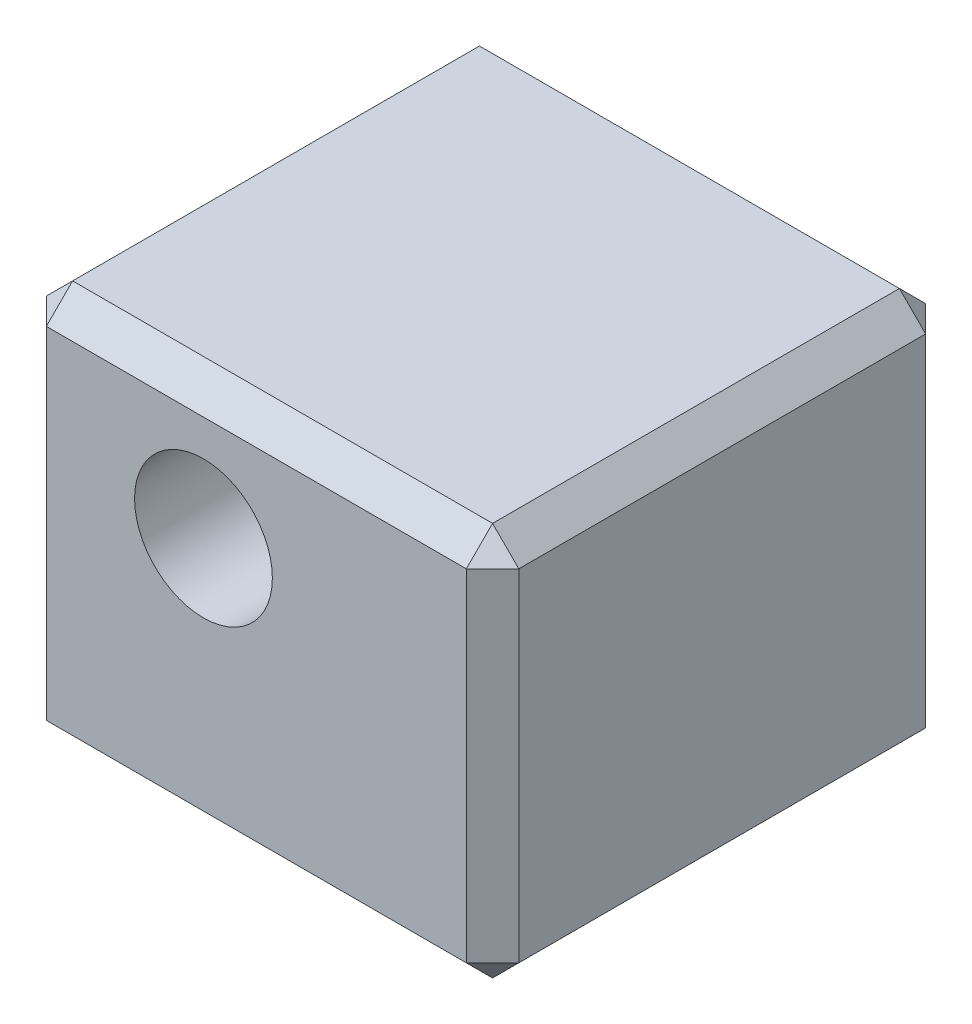
ISO-10303-21;
HEADER;
FILE_DESCRIPTION(('STEP AP214'),'2;1');
FILE_NAME('part.step','',(''),(''),'','','');
FILE_SCHEMA(('AUTOMOTIVE_DESIGN { 1 0 10303 214 1 1 1 1 }'));
ENDSEC;
DATA;
#1=APPLICATION_CONTEXT('core data for automotive mechanical design processes');
#2=APPLICATION_PROTOCOL_DEFINITION('international standard','automotive_design',2000,#1);
#3=PRODUCT_CONTEXT('',#1,'mechanical');
#4=PRODUCT('Part','Part','',(#3));
#5=PRODUCT_RELATED_PRODUCT_CATEGORY('part','',(#4));
#6=PRODUCT_DEFINITION_FORMATION('','',#4);
#7=PRODUCT_DEFINITION_CONTEXT('part definition',#1,'design');
#8=PRODUCT_DEFINITION('design','',#6,#7);
#9=PRODUCT_DEFINITION_SHAPE('','',#8);
#10=(LENGTH_UNIT() NAMED_UNIT(*) SI_UNIT(.MILLI.,.METRE.));
#11=(NAMED_UNIT(*) PLANE_ANGLE_UNIT() SI_UNIT($,.RADIAN.));
#12=(NAMED_UNIT(*) SI_UNIT($,.STERADIAN.) SOLID_ANGLE_UNIT());
#13=UNCERTAINTY_MEASURE_WITH_UNIT(LENGTH_MEASURE(1.E-05),#10,'distance_accuracy_value','');
#14=(GEOMETRIC_REPRESENTATION_CONTEXT(3) GLOBAL_UNCERTAINTY_ASSIGNED_CONTEXT((#13)) GLOBAL_UNIT_ASSIGNED_CONTEXT((#10,
#11,#12)) REPRESENTATION_CONTEXT('',''));
#15=CARTESIAN_POINT('',(0.,0.,0.));
#16=DIRECTION('',(0.,0.,1.));
#17=DIRECTION('',(1.,0.,0.));
#18=AXIS2_PLACEMENT_3D('',#15,#16,#17);
#19=CARTESIAN_POINT('',(-13.2722966665142,15.,-20.6283369875564));
#20=DIRECTION('',(1.,0.,0.));
#21=DIRECTION('',(0.,0.,-1.));
#22=AXIS2_PLACEMENT_3D('',#19,#20,#21);
#23=PLANE('',#22);
#24=DIRECTION('',(0.,0.,-1.));
#25=VECTOR('',#24,1.);
#26=CARTESIAN_POINT('',(-13.2722966665142,14.,-20.6283369875564));
#27=LINE('',#26,#25);
#28=CARTESIAN_POINT('',(-13.2722966665142,14.,-4.1283369875564));
#29=VERTEX_POINT('',#28);
#30=CARTESIAN_POINT('',(-13.2722966665142,14.,-19.6283369875564));
#31=VERTEX_POINT('',#30);
#32=EDGE_CURVE('E184',#29,#31,#27,.T.);
#33=ORIENTED_EDGE('',*,*,#32,.T.);
#34=DIRECTION('',(0.,-1.,0.));
#35=VECTOR('',#34,1.);
#36=CARTESIAN_POINT('',(-13.2722966665142,15.,-19.6283369875564));
#37=LINE('',#36,#35);
#38=CARTESIAN_POINT('',(-13.2722966665142,1.,-19.6283369875564));
#39=VERTEX_POINT('',#38);
#40=EDGE_CURVE('E186',#31,#39,#37,.T.);
#41=ORIENTED_EDGE('',*,*,#40,.T.);
#42=DIRECTION('',(0.,0.,1.));
#43=VECTOR('',#42,1.);
#44=CARTESIAN_POINT('',(-13.2722966665142,1.,-20.6283369875564));
#45=LINE('',#44,#43);
#46=CARTESIAN_POINT('',(-13.2722966665142,1.,-4.1283369875564));
#47=VERTEX_POINT('',#46);
#48=EDGE_CURVE('E180',#39,#47,#45,.T.);
#49=ORIENTED_EDGE('',*,*,#48,.T.);
#50=DIRECTION('',(0.,1.,0.));
#51=VECTOR('',#50,1.);
#52=CARTESIAN_POINT('',(-13.2722966665142,15.,-4.1283369875564));
#53=LINE('',#52,#51);
#54=EDGE_CURVE('E182',#47,#29,#53,.T.);
#55=ORIENTED_EDGE('',*,*,#54,.T.);
#56=EDGE_LOOP('',(#33,#41,#49,#55));
#57=FACE_BOUND('',#56,.T.);
#58=ADVANCED_FACE('F31',(#57),#23,.F.);
#59=CARTESIAN_POINT('',(4.7277033334858,15.,-2.6283369875564));
#60=DIRECTION('',(-1.,0.,0.));
#61=DIRECTION('',(0.,0.,1.));
#62=AXIS2_PLACEMENT_3D('',#59,#60,#61);
#63=PLANE('',#62);
#64=DIRECTION('',(0.,0.,-1.));
#65=VECTOR('',#64,1.);
#66=CARTESIAN_POINT('',(4.7277033334858,1.,-2.6283369875564));
#67=LINE('',#66,#65);
#68=CARTESIAN_POINT('',(4.7277033334858,1.,-4.1283369875564));
#69=VERTEX_POINT('',#68);
#70=CARTESIAN_POINT('',(4.7277033334858,1.,-19.6283369875564));
#71=VERTEX_POINT('',#70);
#72=EDGE_CURVE('E160',#69,#71,#67,.T.);
#73=ORIENTED_EDGE('',*,*,#72,.T.);
#74=DIRECTION('',(0.,1.,0.));
#75=VECTOR('',#74,1.);
#76=CARTESIAN_POINT('',(4.7277033334858,15.,-19.6283369875564));
#77=LINE('',#76,#75);
#78=CARTESIAN_POINT('',(4.7277033334858,14.,-19.6283369875564));
#79=VERTEX_POINT('',#78);
#80=EDGE_CURVE('E130',#71,#79,#77,.T.);
#81=ORIENTED_EDGE('',*,*,#80,.T.);
#82=DIRECTION('',(0.,0.,1.));
#83=VECTOR('',#82,1.);
#84=CARTESIAN_POINT('',(4.7277033334858,14.,-3.1283369875564));
#85=LINE('',#84,#83);
#86=CARTESIAN_POINT('',(4.7277033334858,14.,-4.1283369875564));
#87=VERTEX_POINT('',#86);
#88=EDGE_CURVE('E168',#79,#87,#85,.T.);
#89=ORIENTED_EDGE('',*,*,#88,.T.);
#90=DIRECTION('',(0.,-1.,0.));
#91=VECTOR('',#90,1.);
#92=CARTESIAN_POINT('',(4.7277033334858,15.,-4.1283369875564));
#93=LINE('',#92,#91);
#94=EDGE_CURVE('E162',#87,#69,#93,.T.);
#95=ORIENTED_EDGE('',*,*,#94,.T.);
#96=EDGE_LOOP('',(#73,#81,#89,#95));
#97=FACE_BOUND('',#96,.T.);
#98=ADVANCED_FACE('F293',(#97),#63,.F.);
#99=CARTESIAN_POINT('',(4.7277033334858,15.,-20.6283369875564));
#100=DIRECTION('',(0.,0.,1.));
#101=DIRECTION('',(1.,0.,0.));
#102=AXIS2_PLACEMENT_3D('',#99,#100,#101);
#103=PLANE('',#102);
#104=DIRECTION('',(1.,0.,0.));
#105=VECTOR('',#104,1.);
#106=CARTESIAN_POINT('',(4.7277033334858,14.,-20.6283369875564));
#107=LINE('',#106,#105);
#108=CARTESIAN_POINT('',(-12.2722966665142,14.,-20.6283369875564));
#109=VERTEX_POINT('',#108);
#110=CARTESIAN_POINT('',(3.7277033334858,14.,-20.6283369875564));
#111=VERTEX_POINT('',#110);
#112=EDGE_CURVE('E158',#109,#111,#107,.T.);
#113=ORIENTED_EDGE('',*,*,#112,.T.);
#114=DIRECTION('',(0.,-1.,0.));
#115=VECTOR('',#114,1.);
#116=CARTESIAN_POINT('',(3.7277033334858,15.,-20.6283369875564));
#117=LINE('',#116,#115);
#118=CARTESIAN_POINT('',(3.7277033334858,1.,-20.6283369875564));
#119=VERTEX_POINT('',#118);
#120=EDGE_CURVE('E128',#111,#119,#117,.T.);
#121=ORIENTED_EDGE('',*,*,#120,.T.);
#122=DIRECTION('',(-1.,0.,0.));
#123=VECTOR('',#122,1.);
#124=CARTESIAN_POINT('',(4.7277033334858,1.,-20.6283369875564));
#125=LINE('',#124,#123);
#126=CARTESIAN_POINT('',(-12.2722966665142,1.,-20.6283369875564));
#127=VERTEX_POINT('',#126);
#128=EDGE_CURVE('E146',#119,#127,#125,.T.);
#129=ORIENTED_EDGE('',*,*,#128,.T.);
#130=DIRECTION('',(0.,1.,0.));
#131=VECTOR('',#130,1.);
#132=CARTESIAN_POINT('',(-12.2722966665142,15.,-20.6283369875564));
#133=LINE('',#132,#131);
#134=EDGE_CURVE('E152',#127,#109,#133,.T.);
#135=ORIENTED_EDGE('',*,*,#134,.T.);
#136=EDGE_LOOP('',(#113,#121,#129,#135));
#137=FACE_BOUND('',#136,.T.);
#138=CARTESIAN_POINT('',(-6.2867966665142,10.,-20.6283369875564));
#139=DIRECTION('',(0.,0.,1.));
#140=DIRECTION('',(1.,0.,0.));
#141=AXIS2_PLACEMENT_3D('',#138,#139,#140);
#142=CIRCLE('',#141,2.625);
#143=CARTESIAN_POINT('',(-3.6617966665142,10.,-20.6283369875564));
#144=VERTEX_POINT('',#143);
#145=EDGE_CURVE('E153',#144,#144,#142,.T.);
#146=ORIENTED_EDGE('',*,*,#145,.T.);
#147=EDGE_LOOP('',(#146));
#148=FACE_BOUND('',#147,.T.);
#149=ADVANCED_FACE('F155',(#137,#148),#103,.F.);
#150=CARTESIAN_POINT('',(-13.2722966665142,15.,-2.6283369875564));
#151=DIRECTION('',(0.,1.,0.));
#152=DIRECTION('',(0.,0.,1.));
#153=AXIS2_PLACEMENT_3D('',#150,#151,#152);
#154=PLANE('',#153);
#155=DIRECTION('',(1.,0.,0.));
#156=VECTOR('',#155,1.);
#157=CARTESIAN_POINT('',(4.7277033334858,15.,-4.1283369875564));
#158=LINE('',#157,#156);
#159=CARTESIAN_POINT('',(-12.2722966665142,15.,-4.1283369875564));
#160=VERTEX_POINT('',#159);
#161=CARTESIAN_POINT('',(3.7277033334858,15.,-4.1283369875564));
#162=VERTEX_POINT('',#161);
#163=EDGE_CURVE('E171',#160,#162,#158,.T.);
#164=ORIENTED_EDGE('',*,*,#163,.T.);
#165=DIRECTION('',(0.,0.,-1.));
#166=VECTOR('',#165,1.);
#167=CARTESIAN_POINT('',(3.7277033334858,15.,-20.6283369875564));
#168=LINE('',#167,#166);
#169=CARTESIAN_POINT('',(3.7277033334858,15.,-19.6283369875564));
#170=VERTEX_POINT('',#169);
#171=EDGE_CURVE('E177',#162,#170,#168,.T.);
#172=ORIENTED_EDGE('',*,*,#171,.T.);
#173=DIRECTION('',(-1.,0.,0.));
#174=VECTOR('',#173,1.);
#175=CARTESIAN_POINT('',(-13.2722966665142,15.,-19.6283369875564));
#176=LINE('',#175,#174);
#177=CARTESIAN_POINT('',(-12.2722966665142,15.,-19.6283369875564));
#178=VERTEX_POINT('',#177);
#179=EDGE_CURVE('E175',#170,#178,#176,.T.);
#180=ORIENTED_EDGE('',*,*,#179,.T.);
#181=DIRECTION('',(0.,0.,1.));
#182=VECTOR('',#181,1.);
#183=CARTESIAN_POINT('',(-12.2722966665142,15.,-3.1283369875564));
#184=LINE('',#183,#182);
#185=EDGE_CURVE('E173',#178,#160,#184,.T.);
#186=ORIENTED_EDGE('',*,*,#185,.T.);
#187=EDGE_LOOP('',(#164,#172,#180,#186));
#188=FACE_BOUND('',#187,.T.);
#189=ADVANCED_FACE('F516',(#188),#154,.T.);
#190=CARTESIAN_POINT('',(-13.2722966665142,0.,-2.6283369875564));
#191=DIRECTION('',(0.,1.,0.));
#192=DIRECTION('',(0.,0.,1.));
#193=AXIS2_PLACEMENT_3D('',#190,#191,#192);
#194=PLANE('',#193);
#195=DIRECTION('',(1.,0.,0.));
#196=VECTOR('',#195,1.);
#197=CARTESIAN_POINT('',(-13.2722966665142,0.,-19.6283369875564));
#198=LINE('',#197,#196);
#199=CARTESIAN_POINT('',(-12.2722966665142,0.,-19.6283369875564));
#200=VERTEX_POINT('',#199);
#201=CARTESIAN_POINT('',(3.7277033334858,0.,-19.6283369875564));
#202=VERTEX_POINT('',#201);
#203=EDGE_CURVE('E198',#200,#202,#198,.T.);
#204=ORIENTED_EDGE('',*,*,#203,.T.);
#205=DIRECTION('',(0.,0.,1.));
#206=VECTOR('',#205,1.);
#207=CARTESIAN_POINT('',(3.7277033334858,0.,-2.6283369875564));
#208=LINE('',#207,#206);
#209=CARTESIAN_POINT('',(3.7277033334858,0.,-4.1283369875564));
#210=VERTEX_POINT('',#209);
#211=EDGE_CURVE('E11',#202,#210,#208,.T.);
#212=ORIENTED_EDGE('',*,*,#211,.T.);
#213=DIRECTION('',(-1.,0.,0.));
#214=VECTOR('',#213,1.);
#215=CARTESIAN_POINT('',(-13.2722966665142,0.,-4.1283369875564));
#216=LINE('',#215,#214);
#217=CARTESIAN_POINT('',(-12.2722966665142,0.,-4.1283369875564));
#218=VERTEX_POINT('',#217);
#219=EDGE_CURVE('E40',#210,#218,#216,.T.);
#220=ORIENTED_EDGE('',*,*,#219,.T.);
#221=DIRECTION('',(0.,0.,-1.));
#222=VECTOR('',#221,1.);
#223=CARTESIAN_POINT('',(-12.2722966665142,0.,-2.6283369875564));
#224=LINE('',#223,#222);
#225=EDGE_CURVE('E200',#218,#200,#224,.T.);
#226=ORIENTED_EDGE('',*,*,#225,.T.);
#227=EDGE_LOOP('',(#204,#212,#220,#226));
#228=FACE_BOUND('',#227,.T.);
#229=CARTESIAN_POINT('',(-4.27229666651419,0.,-11.6283369875564));
#230=DIRECTION('',(0.,-1.,0.));
#231=DIRECTION('',(0.,0.,-1.));
#232=AXIS2_PLACEMENT_3D('',#229,#230,#231);
#233=CIRCLE('',#232,5.75);
#234=CARTESIAN_POINT('',(-4.27229666651419,0.,-17.3783369875564));
#235=VERTEX_POINT('',#234);
#236=EDGE_CURVE('E262',#235,#235,#233,.T.);
#237=ORIENTED_EDGE('',*,*,#236,.F.);
#238=EDGE_LOOP('',(#237));
#239=FACE_BOUND('',#238,.T.);
#240=ADVANCED_FACE('F296',(#228,#239),#194,.F.);
#241=CARTESIAN_POINT('',(-6.2867966665142,10.,-20.6283369875564));
#242=DIRECTION('',(0.,0.,1.));
#243=DIRECTION('',(1.,0.,0.));
#244=AXIS2_PLACEMENT_3D('',#241,#242,#243);
#245=CYLINDRICAL_SURFACE('',#244,2.625);
#246=CARTESIAN_POINT('',(-6.2867966665142,10.,-3.1283369875564));
#247=DIRECTION('',(0.,0.,-1.));
#248=DIRECTION('',(-1.,0.,0.));
#249=AXIS2_PLACEMENT_3D('',#246,#247,#248);
#250=CIRCLE('',#249,2.625);
#251=CARTESIAN_POINT('',(-8.9117966665142,10.,-3.1283369875564));
#252=VERTEX_POINT('',#251);
#253=EDGE_CURVE('E256',#252,#252,#250,.F.);
#254=ORIENTED_EDGE('',*,*,#253,.T.);
#255=EDGE_LOOP('',(#254));
#256=FACE_BOUND('',#255,.T.);
#257=ORIENTED_EDGE('',*,*,#145,.F.);
#258=EDGE_LOOP('',(#257));
#259=FACE_BOUND('',#258,.T.);
#260=ADVANCED_FACE('F502',(#256,#259),#245,.F.);
#261=CARTESIAN_POINT('',(-4.27229666651419,7.,-11.6283369875564));
#262=DIRECTION('',(0.,-1.,0.));
#263=DIRECTION('',(0.,0.,-1.));
#264=AXIS2_PLACEMENT_3D('',#261,#262,#263);
#265=CYLINDRICAL_SURFACE('',#264,5.75);
#266=CARTESIAN_POINT('',(-4.27229666651419,7.,-11.6283369875564));
#267=DIRECTION('',(0.,-1.,0.));
#268=DIRECTION('',(0.,0.,-1.));
#269=AXIS2_PLACEMENT_3D('',#266,#267,#268);
#270=CIRCLE('',#269,5.75);
#271=CARTESIAN_POINT('',(-4.27229666651419,7.,-17.3783369875564));
#272=VERTEX_POINT('',#271);
#273=EDGE_CURVE('E267',#272,#272,#270,.T.);
#274=ORIENTED_EDGE('',*,*,#273,.F.);
#275=EDGE_LOOP('',(#274));
#276=FACE_BOUND('',#275,.T.);
#277=ORIENTED_EDGE('',*,*,#236,.T.);
#278=EDGE_LOOP('',(#277));
#279=FACE_BOUND('',#278,.T.);
#280=ADVANCED_FACE('F492',(#276,#279),#265,.F.);
#281=CARTESIAN_POINT('',(-4.27229666651419,7.,-11.6283369875564));
#282=DIRECTION('',(0.,-1.,0.));
#283=DIRECTION('',(0.,0.,-1.));
#284=AXIS2_PLACEMENT_3D('',#281,#282,#283);
#285=PLANE('',#284);
#286=ORIENTED_EDGE('',*,*,#273,.T.);
#287=EDGE_LOOP('',(#286));
#288=FACE_BOUND('',#287,.T.);
#289=ADVANCED_FACE('F482',(#288),#285,.T.);
#290=CARTESIAN_POINT('',(4.7277033334858,15.,-3.1283369875564));
#291=DIRECTION('',(0.,0.,-1.));
#292=DIRECTION('',(-1.,0.,0.));
#293=AXIS2_PLACEMENT_3D('',#290,#291,#292);
#294=PLANE('',#293);
#295=DIRECTION('',(-1.,0.,0.));
#296=VECTOR('',#295,1.);
#297=CARTESIAN_POINT('',(-13.2722966665142,14.,-3.1283369875564));
#298=LINE('',#297,#296);
#299=CARTESIAN_POINT('',(3.7277033334858,14.,-3.1283369875564));
#300=VERTEX_POINT('',#299);
#301=CARTESIAN_POINT('',(-12.2722966665142,14.,-3.1283369875564));
#302=VERTEX_POINT('',#301);
#303=EDGE_CURVE('E193',#300,#302,#298,.T.);
#304=ORIENTED_EDGE('',*,*,#303,.T.);
#305=DIRECTION('',(0.,-1.,0.));
#306=VECTOR('',#305,1.);
#307=CARTESIAN_POINT('',(-12.2722966665142,15.,-3.1283369875564));
#308=LINE('',#307,#306);
#309=CARTESIAN_POINT('',(-12.2722966665142,1.,-3.1283369875564));
#310=VERTEX_POINT('',#309);
#311=EDGE_CURVE('E195',#302,#310,#308,.T.);
#312=ORIENTED_EDGE('',*,*,#311,.T.);
#313=DIRECTION('',(1.,0.,0.));
#314=VECTOR('',#313,1.);
#315=CARTESIAN_POINT('',(4.7277033334858,1.,-3.1283369875564));
#316=LINE('',#315,#314);
#317=CARTESIAN_POINT('',(3.7277033334858,1.,-3.1283369875564));
#318=VERTEX_POINT('',#317);
#319=EDGE_CURVE('E189',#310,#318,#316,.T.);
#320=ORIENTED_EDGE('',*,*,#319,.T.);
#321=DIRECTION('',(0.,1.,0.));
#322=VECTOR('',#321,1.);
#323=CARTESIAN_POINT('',(3.7277033334858,15.,-3.1283369875564));
#324=LINE('',#323,#322);
#325=EDGE_CURVE('E191',#318,#300,#324,.T.);
#326=ORIENTED_EDGE('',*,*,#325,.T.);
#327=EDGE_LOOP('',(#304,#312,#320,#326));
#328=FACE_BOUND('',#327,.T.);
#329=ORIENTED_EDGE('',*,*,#253,.F.);
#330=EDGE_LOOP('',(#329));
#331=FACE_BOUND('',#330,.T.);
#332=ADVANCED_FACE('F474',(#328,#331),#294,.F.);
#333=CARTESIAN_POINT('',(-12.2722966665142,15.,-3.1283369875564));
#334=DIRECTION('',(0.707106781186548,0.,-0.707106781186547));
#335=DIRECTION('',(-0.707106781186547,0.,-0.707106781186548));
#336=AXIS2_PLACEMENT_3D('',#333,#334,#335);
#337=PLANE('',#336);
#338=DIRECTION('',(-0.707106781186547,0.,-0.707106781186548));
#339=VECTOR('',#338,1.);
#340=CARTESIAN_POINT('',(-12.7722966665142,14.,-3.6283369875564));
#341=LINE('',#340,#339);
#342=EDGE_CURVE('E35',#29,#302,#341,.F.);
#343=ORIENTED_EDGE('',*,*,#342,.F.);
#344=ORIENTED_EDGE('',*,*,#54,.F.);
#345=DIRECTION('',(0.707106781186547,0.,0.707106781186548));
#346=VECTOR('',#345,1.);
#347=CARTESIAN_POINT('',(-12.2722966665142,1.,-3.1283369875564));
#348=LINE('',#347,#346);
#349=EDGE_CURVE('E249',#310,#47,#348,.F.);
#350=ORIENTED_EDGE('',*,*,#349,.F.);
#351=ORIENTED_EDGE('',*,*,#311,.F.);
#352=EDGE_LOOP('',(#343,#344,#350,#351));
#353=FACE_BOUND('',#352,.T.);
#354=ADVANCED_FACE('F33',(#353),#337,.F.);
#355=CARTESIAN_POINT('',(-12.2722966665142,15.,-4.1283369875564));
#356=DIRECTION('',(-0.577350269189626,0.577350269189626,0.577350269189625));
#357=DIRECTION('',(-0.707106781186548,-0.707106781186548,0.));
#358=AXIS2_PLACEMENT_3D('',#355,#356,#357);
#359=PLANE('',#358);
#360=DIRECTION('',(-0.707106781186547,-0.707106781186547,0.));
#361=VECTOR('',#360,1.);
#362=CARTESIAN_POINT('',(-12.2722966665142,15.,-4.1283369875564));
#363=LINE('',#362,#361);
#364=EDGE_CURVE('E244',#29,#160,#363,.F.);
#365=ORIENTED_EDGE('',*,*,#364,.F.);
#366=ORIENTED_EDGE('',*,*,#342,.T.);
#367=DIRECTION('',(0.,0.707106781186547,-0.707106781186548));
#368=VECTOR('',#367,1.);
#369=CARTESIAN_POINT('',(-12.2722966665142,15.,-4.1283369875564));
#370=LINE('',#369,#368);
#371=EDGE_CURVE('E247',#160,#302,#370,.F.);
#372=ORIENTED_EDGE('',*,*,#371,.F.);
#373=EDGE_LOOP('',(#365,#366,#372));
#374=FACE_BOUND('',#373,.T.);
#375=ADVANCED_FACE('F460',(#374),#359,.T.);
#376=CARTESIAN_POINT('',(-12.2722966665142,1.,-3.1283369875564));
#377=DIRECTION('',(-0.577350269189626,-0.577350269189626,0.577350269189625));
#378=DIRECTION('',(0.707106781186547,-0.707106781186548,0.));
#379=AXIS2_PLACEMENT_3D('',#376,#377,#378);
#380=PLANE('',#379);
#381=DIRECTION('',(0.,-0.707106781186547,-0.707106781186548));
#382=VECTOR('',#381,1.);
#383=CARTESIAN_POINT('',(-12.2722966665142,1.,-3.1283369875564));
#384=LINE('',#383,#382);
#385=EDGE_CURVE('E239',#310,#218,#384,.T.);
#386=ORIENTED_EDGE('',*,*,#385,.F.);
#387=ORIENTED_EDGE('',*,*,#349,.T.);
#388=DIRECTION('',(-0.707106781186547,0.707106781186547,0.));
#389=VECTOR('',#388,1.);
#390=CARTESIAN_POINT('',(-12.7722966665142,0.500000000000001,-4.1283369875564));
#391=LINE('',#390,#389);
#392=EDGE_CURVE('E241',#218,#47,#391,.T.);
#393=ORIENTED_EDGE('',*,*,#392,.F.);
#394=EDGE_LOOP('',(#386,#387,#393));
#395=FACE_BOUND('',#394,.T.);
#396=ADVANCED_FACE('F451',(#395),#380,.T.);
#397=CARTESIAN_POINT('',(4.7277033334858,14.,-3.1283369875564));
#398=DIRECTION('',(0.,0.707106781186548,0.707106781186547));
#399=DIRECTION('',(0.,-0.707106781186547,0.707106781186548));
#400=AXIS2_PLACEMENT_3D('',#397,#398,#399);
#401=PLANE('',#400);
#402=ORIENTED_EDGE('',*,*,#371,.T.);
#403=ORIENTED_EDGE('',*,*,#303,.F.);
#404=DIRECTION('',(0.,-0.707106781186547,0.707106781186548));
#405=VECTOR('',#404,1.);
#406=CARTESIAN_POINT('',(3.7277033334858,14.5,-3.6283369875564));
#407=LINE('',#406,#405);
#408=EDGE_CURVE('E233',#162,#300,#407,.T.);
#409=ORIENTED_EDGE('',*,*,#408,.F.);
#410=ORIENTED_EDGE('',*,*,#163,.F.);
#411=EDGE_LOOP('',(#402,#403,#409,#410));
#412=FACE_BOUND('',#411,.T.);
#413=ADVANCED_FACE('F442',(#412),#401,.T.);
#414=CARTESIAN_POINT('',(-12.2722966665142,15.,-2.6283369875564));
#415=DIRECTION('',(-0.707106781186547,0.707106781186547,0.));
#416=DIRECTION('',(-0.707106781186548,-0.707106781186548,0.));
#417=AXIS2_PLACEMENT_3D('',#414,#415,#416);
#418=PLANE('',#417);
#419=ORIENTED_EDGE('',*,*,#364,.T.);
#420=ORIENTED_EDGE('',*,*,#185,.F.);
#421=DIRECTION('',(0.707106781186548,0.707106781186548,0.));
#422=VECTOR('',#421,1.);
#423=CARTESIAN_POINT('',(-12.2722966665142,15.,-19.6283369875564));
#424=LINE('',#423,#422);
#425=EDGE_CURVE('E230',#31,#178,#424,.T.);
#426=ORIENTED_EDGE('',*,*,#425,.F.);
#427=ORIENTED_EDGE('',*,*,#32,.F.);
#428=EDGE_LOOP('',(#419,#420,#426,#427));
#429=FACE_BOUND('',#428,.T.);
#430=ADVANCED_FACE('F434',(#429),#418,.T.);
#431=CARTESIAN_POINT('',(-13.2722966665142,15.,-19.6283369875564));
#432=DIRECTION('',(0.707106781186547,0.,0.707106781186547));
#433=DIRECTION('',(0.707106781186548,0.,-0.707106781186548));
#434=AXIS2_PLACEMENT_3D('',#431,#432,#433);
#435=PLANE('',#434);
#436=DIRECTION('',(-0.707106781186548,0.,0.707106781186548));
#437=VECTOR('',#436,1.);
#438=CARTESIAN_POINT('',(-13.2722966665142,1.,-19.6283369875564));
#439=LINE('',#438,#437);
#440=EDGE_CURVE('E224',#39,#127,#439,.F.);
#441=ORIENTED_EDGE('',*,*,#440,.F.);
#442=ORIENTED_EDGE('',*,*,#40,.F.);
#443=DIRECTION('',(0.707106781186548,0.,-0.707106781186548));
#444=VECTOR('',#443,1.);
#445=CARTESIAN_POINT('',(-12.7722966665142,14.,-20.1283369875564));
#446=LINE('',#445,#444);
#447=EDGE_CURVE('E227',#109,#31,#446,.F.);
#448=ORIENTED_EDGE('',*,*,#447,.F.);
#449=ORIENTED_EDGE('',*,*,#134,.F.);
#450=EDGE_LOOP('',(#441,#442,#448,#449));
#451=FACE_BOUND('',#450,.T.);
#452=ADVANCED_FACE('F275',(#451),#435,.F.);
#453=CARTESIAN_POINT('',(-13.2722966665142,1.,-20.6283369875564));
#454=DIRECTION('',(0.707106781186547,0.707106781186547,0.));
#455=DIRECTION('',(-0.707106781186548,0.707106781186548,0.));
#456=AXIS2_PLACEMENT_3D('',#453,#454,#455);
#457=PLANE('',#456);
#458=ORIENTED_EDGE('',*,*,#392,.T.);
#459=ORIENTED_EDGE('',*,*,#48,.F.);
#460=DIRECTION('',(0.707106781186548,-0.707106781186548,0.));
#461=VECTOR('',#460,1.);
#462=CARTESIAN_POINT('',(-13.2722966665142,1.,-19.6283369875564));
#463=LINE('',#462,#461);
#464=EDGE_CURVE('E222',#200,#39,#463,.F.);
#465=ORIENTED_EDGE('',*,*,#464,.F.);
#466=ORIENTED_EDGE('',*,*,#225,.F.);
#467=EDGE_LOOP('',(#458,#459,#465,#466));
#468=FACE_BOUND('',#467,.T.);
#469=ADVANCED_FACE('F302',(#468),#457,.F.);
#470=CARTESIAN_POINT('',(4.7277033334858,1.,-3.1283369875564));
#471=DIRECTION('',(0.,0.707106781186548,-0.707106781186547));
#472=DIRECTION('',(0.,0.707106781186547,0.707106781186548));
#473=AXIS2_PLACEMENT_3D('',#470,#471,#472);
#474=PLANE('',#473);
#475=ORIENTED_EDGE('',*,*,#385,.T.);
#476=ORIENTED_EDGE('',*,*,#219,.F.);
#477=DIRECTION('',(0.,0.707106781186547,0.707106781186548));
#478=VECTOR('',#477,1.);
#479=CARTESIAN_POINT('',(3.7277033334858,0.500000000000001,-3.6283369875564));
#480=LINE('',#479,#478);
#481=EDGE_CURVE('E220',#318,#210,#480,.F.);
#482=ORIENTED_EDGE('',*,*,#481,.F.);
#483=ORIENTED_EDGE('',*,*,#319,.F.);
#484=EDGE_LOOP('',(#475,#476,#482,#483));
#485=FACE_BOUND('',#484,.T.);
#486=ADVANCED_FACE('F410',(#485),#474,.F.);
#487=CARTESIAN_POINT('',(3.7277033334858,15.,-3.1283369875564));
#488=DIRECTION('',(-0.707106781186548,0.,-0.707106781186547));
#489=DIRECTION('',(-0.707106781186547,0.,0.707106781186548));
#490=AXIS2_PLACEMENT_3D('',#487,#488,#489);
#491=PLANE('',#490);
#492=DIRECTION('',(-0.707106781186547,0.,0.707106781186548));
#493=VECTOR('',#492,1.);
#494=CARTESIAN_POINT('',(4.7277033334858,14.,-4.1283369875564));
#495=LINE('',#494,#493);
#496=EDGE_CURVE('E236',#300,#87,#495,.F.);
#497=ORIENTED_EDGE('',*,*,#496,.F.);
#498=ORIENTED_EDGE('',*,*,#325,.F.);
#499=DIRECTION('',(0.707106781186547,0.,-0.707106781186548));
#500=VECTOR('',#499,1.);
#501=CARTESIAN_POINT('',(4.7277033334858,1.,-4.1283369875564));
#502=LINE('',#501,#500);
#503=EDGE_CURVE('E217',#69,#318,#502,.F.);
#504=ORIENTED_EDGE('',*,*,#503,.F.);
#505=ORIENTED_EDGE('',*,*,#94,.F.);
#506=EDGE_LOOP('',(#497,#498,#504,#505));
#507=FACE_BOUND('',#506,.T.);
#508=ADVANCED_FACE('F401',(#507),#491,.F.);
#509=CARTESIAN_POINT('',(4.7277033334858,14.,-4.1283369875564));
#510=DIRECTION('',(0.577350269189626,0.577350269189627,0.577350269189625));
#511=DIRECTION('',(-0.707106781186548,0.707106781186547,0.));
#512=AXIS2_PLACEMENT_3D('',#509,#510,#511);
#513=PLANE('',#512);
#514=ORIENTED_EDGE('',*,*,#408,.T.);
#515=ORIENTED_EDGE('',*,*,#496,.T.);
#516=DIRECTION('',(-0.707106781186548,0.707106781186547,0.));
#517=VECTOR('',#516,1.);
#518=CARTESIAN_POINT('',(4.7277033334858,14.,-4.1283369875564));
#519=LINE('',#518,#517);
#520=EDGE_CURVE('E214',#162,#87,#519,.F.);
#521=ORIENTED_EDGE('',*,*,#520,.F.);
#522=EDGE_LOOP('',(#514,#515,#521));
#523=FACE_BOUND('',#522,.T.);
#524=ADVANCED_FACE('F314',(#523),#513,.T.);
#525=CARTESIAN_POINT('',(-12.2722966665142,15.,-19.6283369875564));
#526=DIRECTION('',(-0.577350269189625,0.577350269189627,-0.577350269189625));
#527=DIRECTION('',(0.,0.707106781186546,0.707106781186549));
#528=AXIS2_PLACEMENT_3D('',#525,#526,#527);
#529=PLANE('',#528);
#530=ORIENTED_EDGE('',*,*,#447,.T.);
#531=ORIENTED_EDGE('',*,*,#425,.T.);
#532=DIRECTION('',(0.,-0.707106781186546,-0.707106781186549));
#533=VECTOR('',#532,1.);
#534=CARTESIAN_POINT('',(-12.2722966665142,15.,-19.6283369875564));
#535=LINE('',#534,#533);
#536=EDGE_CURVE('E211',#109,#178,#535,.F.);
#537=ORIENTED_EDGE('',*,*,#536,.F.);
#538=EDGE_LOOP('',(#530,#531,#537));
#539=FACE_BOUND('',#538,.T.);
#540=ADVANCED_FACE('F278',(#539),#529,.T.);
#541=CARTESIAN_POINT('',(-13.2722966665142,1.,-19.6283369875564));
#542=DIRECTION('',(-0.577350269189625,-0.577350269189627,-0.577350269189625));
#543=DIRECTION('',(0.,0.707106781186546,-0.707106781186549));
#544=AXIS2_PLACEMENT_3D('',#541,#542,#543);
#545=PLANE('',#544);
#546=ORIENTED_EDGE('',*,*,#464,.T.);
#547=ORIENTED_EDGE('',*,*,#440,.T.);
#548=DIRECTION('',(0.,0.707106781186546,-0.707106781186549));
#549=VECTOR('',#548,1.);
#550=CARTESIAN_POINT('',(-12.2722966665142,0.5,-20.1283369875564));
#551=LINE('',#550,#549);
#552=EDGE_CURVE('E149',#200,#127,#551,.T.);
#553=ORIENTED_EDGE('',*,*,#552,.F.);
#554=EDGE_LOOP('',(#546,#547,#553));
#555=FACE_BOUND('',#554,.T.);
#556=ADVANCED_FACE('F304',(#555),#545,.T.);
#557=CARTESIAN_POINT('',(4.7277033334858,1.,-4.1283369875564));
#558=DIRECTION('',(0.577350269189626,-0.577350269189627,0.577350269189625));
#559=DIRECTION('',(0.707106781186548,0.707106781186547,0.));
#560=AXIS2_PLACEMENT_3D('',#557,#558,#559);
#561=PLANE('',#560);
#562=ORIENTED_EDGE('',*,*,#503,.T.);
#563=ORIENTED_EDGE('',*,*,#481,.T.);
#564=DIRECTION('',(-0.707106781186548,-0.707106781186547,0.));
#565=VECTOR('',#564,1.);
#566=CARTESIAN_POINT('',(4.7277033334858,1.,-4.1283369875564));
#567=LINE('',#566,#565);
#568=EDGE_CURVE('E48',#69,#210,#567,.T.);
#569=ORIENTED_EDGE('',*,*,#568,.F.);
#570=EDGE_LOOP('',(#562,#563,#569));
#571=FACE_BOUND('',#570,.T.);
#572=ADVANCED_FACE('F306',(#571),#561,.T.);
#573=CARTESIAN_POINT('',(3.7277033334858,15.,-2.6283369875564));
#574=DIRECTION('',(0.707106781186547,0.707106781186548,0.));
#575=DIRECTION('',(-0.707106781186548,0.707106781186547,0.));
#576=AXIS2_PLACEMENT_3D('',#573,#574,#575);
#577=PLANE('',#576);
#578=ORIENTED_EDGE('',*,*,#520,.T.);
#579=ORIENTED_EDGE('',*,*,#88,.F.);
#580=DIRECTION('',(0.707106781186548,-0.707106781186547,0.));
#581=VECTOR('',#580,1.);
#582=CARTESIAN_POINT('',(4.7277033334858,14.,-19.6283369875564));
#583=LINE('',#582,#581);
#584=EDGE_CURVE('E206',#170,#79,#583,.T.);
#585=ORIENTED_EDGE('',*,*,#584,.F.);
#586=ORIENTED_EDGE('',*,*,#171,.F.);
#587=EDGE_LOOP('',(#578,#579,#585,#586));
#588=FACE_BOUND('',#587,.T.);
#589=ADVANCED_FACE('F289',(#588),#577,.T.);
#590=CARTESIAN_POINT('',(-13.2722966665142,15.,-19.6283369875564));
#591=DIRECTION('',(0.,0.707106781186549,-0.707106781186546));
#592=DIRECTION('',(0.,0.707106781186546,0.707106781186549));
#593=AXIS2_PLACEMENT_3D('',#590,#591,#592);
#594=PLANE('',#593);
#595=ORIENTED_EDGE('',*,*,#536,.T.);
#596=ORIENTED_EDGE('',*,*,#179,.F.);
#597=DIRECTION('',(0.,0.707106781186546,0.707106781186549));
#598=VECTOR('',#597,1.);
#599=CARTESIAN_POINT('',(3.7277033334858,14.5,-20.1283369875564));
#600=LINE('',#599,#598);
#601=EDGE_CURVE('E143',#111,#170,#600,.T.);
#602=ORIENTED_EDGE('',*,*,#601,.F.);
#603=ORIENTED_EDGE('',*,*,#112,.F.);
#604=EDGE_LOOP('',(#595,#596,#602,#603));
#605=FACE_BOUND('',#604,.T.);
#606=ADVANCED_FACE('F281',(#605),#594,.T.);
#607=CARTESIAN_POINT('',(4.7277033334858,1.,-20.6283369875564));
#608=DIRECTION('',(0.,0.707106781186549,0.707106781186546));
#609=DIRECTION('',(0.,-0.707106781186546,0.707106781186549));
#610=AXIS2_PLACEMENT_3D('',#607,#608,#609);
#611=PLANE('',#610);
#612=ORIENTED_EDGE('',*,*,#552,.T.);
#613=ORIENTED_EDGE('',*,*,#128,.F.);
#614=DIRECTION('',(0.,-0.707106781186546,0.707106781186549));
#615=VECTOR('',#614,1.);
#616=CARTESIAN_POINT('',(3.7277033334858,1.,-20.6283369875564));
#617=LINE('',#616,#615);
#618=EDGE_CURVE('E136',#202,#119,#617,.F.);
#619=ORIENTED_EDGE('',*,*,#618,.F.);
#620=ORIENTED_EDGE('',*,*,#203,.F.);
#621=EDGE_LOOP('',(#612,#613,#619,#620));
#622=FACE_BOUND('',#621,.T.);
#623=ADVANCED_FACE('F147',(#622),#611,.F.);
#624=CARTESIAN_POINT('',(4.7277033334858,1.,-2.6283369875564));
#625=DIRECTION('',(-0.707106781186547,0.707106781186548,0.));
#626=DIRECTION('',(-0.707106781186548,-0.707106781186547,0.));
#627=AXIS2_PLACEMENT_3D('',#624,#625,#626);
#628=PLANE('',#627);
#629=ORIENTED_EDGE('',*,*,#568,.T.);
#630=ORIENTED_EDGE('',*,*,#211,.F.);
#631=DIRECTION('',(0.707106781186548,0.707106781186547,0.));
#632=VECTOR('',#631,1.);
#633=CARTESIAN_POINT('',(4.22770333348581,0.500000000000002,-19.6283369875564));
#634=LINE('',#633,#632);
#635=EDGE_CURVE('E140',#71,#202,#634,.F.);
#636=ORIENTED_EDGE('',*,*,#635,.F.);
#637=ORIENTED_EDGE('',*,*,#72,.F.);
#638=EDGE_LOOP('',(#629,#630,#636,#637));
#639=FACE_BOUND('',#638,.T.);
#640=ADVANCED_FACE('F295',(#639),#628,.F.);
#641=CARTESIAN_POINT('',(4.7277033334858,14.,-19.6283369875564));
#642=DIRECTION('',(0.577350269189625,0.577350269189628,-0.577350269189625));
#643=DIRECTION('',(0.,0.707106781186546,0.707106781186549));
#644=AXIS2_PLACEMENT_3D('',#641,#642,#643);
#645=PLANE('',#644);
#646=ORIENTED_EDGE('',*,*,#601,.T.);
#647=ORIENTED_EDGE('',*,*,#584,.T.);
#648=DIRECTION('',(0.707106781186548,0.,0.707106781186548));
#649=VECTOR('',#648,1.);
#650=CARTESIAN_POINT('',(4.7277033334858,14.,-19.6283369875564));
#651=LINE('',#650,#649);
#652=EDGE_CURVE('E133',#111,#79,#651,.T.);
#653=ORIENTED_EDGE('',*,*,#652,.F.);
#654=EDGE_LOOP('',(#646,#647,#653));
#655=FACE_BOUND('',#654,.T.);
#656=ADVANCED_FACE('F285',(#655),#645,.T.);
#657=CARTESIAN_POINT('',(3.7277033334858,1.,-20.6283369875564));
#658=DIRECTION('',(0.577350269189625,-0.577350269189628,-0.577350269189625));
#659=DIRECTION('',(0.,0.707106781186546,-0.707106781186549));
#660=AXIS2_PLACEMENT_3D('',#657,#658,#659);
#661=PLANE('',#660);
#662=ORIENTED_EDGE('',*,*,#635,.T.);
#663=ORIENTED_EDGE('',*,*,#618,.T.);
#664=DIRECTION('',(-0.707106781186548,0.,-0.707106781186548));
#665=VECTOR('',#664,1.);
#666=CARTESIAN_POINT('',(3.7277033334858,1.,-20.6283369875564));
#667=LINE('',#666,#665);
#668=EDGE_CURVE('E124',#71,#119,#667,.T.);
#669=ORIENTED_EDGE('',*,*,#668,.F.);
#670=EDGE_LOOP('',(#662,#663,#669));
#671=FACE_BOUND('',#670,.T.);
#672=ADVANCED_FACE('F138',(#671),#661,.T.);
#673=CARTESIAN_POINT('',(3.7277033334858,15.,-20.6283369875564));
#674=DIRECTION('',(-0.707106781186547,0.,0.707106781186547));
#675=DIRECTION('',(0.707106781186548,0.,0.707106781186548));
#676=AXIS2_PLACEMENT_3D('',#673,#674,#675);
#677=PLANE('',#676);
#678=ORIENTED_EDGE('',*,*,#652,.T.);
#679=ORIENTED_EDGE('',*,*,#80,.F.);
#680=ORIENTED_EDGE('',*,*,#668,.T.);
#681=ORIENTED_EDGE('',*,*,#120,.F.);
#682=EDGE_LOOP('',(#678,#679,#680,#681));
#683=FACE_BOUND('',#682,.T.);
#684=ADVANCED_FACE('F126',(#683),#677,.F.);
#685=CLOSED_SHELL('',(#58,#98,#149,#189,#240,#260,#280,#289,#332,#354,#375,#396,#413,#430,#452,
#469,#486,#508,#524,#540,#556,#572,#589,#606,#623,#640,#656,#672,#684));
#686=MANIFOLD_SOLID_BREP('B2',#685);
#687=ADVANCED_BREP_SHAPE_REPRESENTATION('',(#18,#686),#14);
#688=SHAPE_DEFINITION_REPRESENTATION(#9,#687);
ENDSEC;
END-ISO-10303-21;
